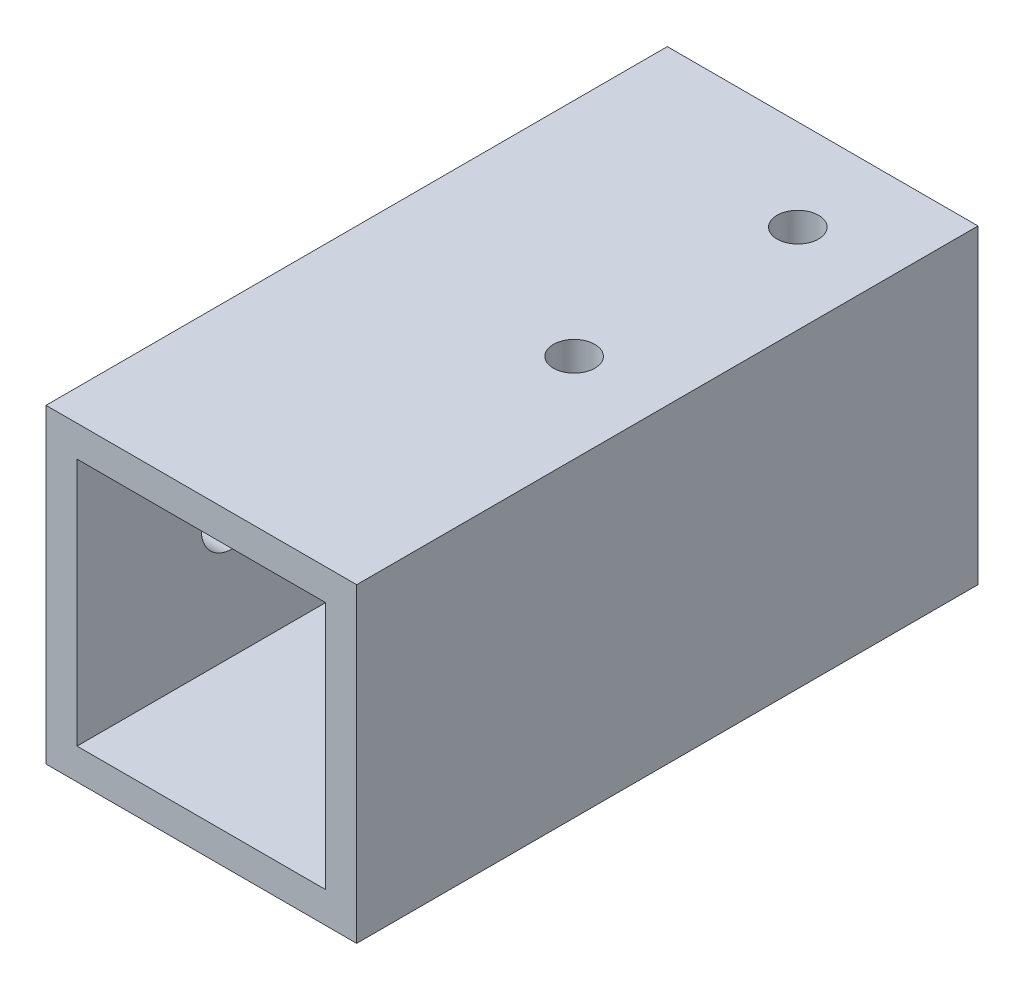
ISO-10303-21;
HEADER;
FILE_DESCRIPTION(('STEP AP214'),'2;1');
FILE_NAME('part.step','',(''),(''),'','','');
FILE_SCHEMA(('AUTOMOTIVE_DESIGN { 1 0 10303 214 1 1 1 1 }'));
ENDSEC;
DATA;
#1=APPLICATION_CONTEXT('core data for automotive mechanical design processes');
#2=APPLICATION_PROTOCOL_DEFINITION('international standard','automotive_design',2000,#1);
#3=PRODUCT_CONTEXT('',#1,'mechanical');
#4=PRODUCT('Part','Part','',(#3));
#5=PRODUCT_RELATED_PRODUCT_CATEGORY('part','',(#4));
#6=PRODUCT_DEFINITION_FORMATION('','',#4);
#7=PRODUCT_DEFINITION_CONTEXT('part definition',#1,'design');
#8=PRODUCT_DEFINITION('design','',#6,#7);
#9=PRODUCT_DEFINITION_SHAPE('','',#8);
#10=(LENGTH_UNIT() NAMED_UNIT(*) SI_UNIT(.MILLI.,.METRE.));
#11=(NAMED_UNIT(*) PLANE_ANGLE_UNIT() SI_UNIT($,.RADIAN.));
#12=(NAMED_UNIT(*) SI_UNIT($,.STERADIAN.) SOLID_ANGLE_UNIT());
#13=UNCERTAINTY_MEASURE_WITH_UNIT(LENGTH_MEASURE(1.E-05),#10,'distance_accuracy_value','');
#14=(GEOMETRIC_REPRESENTATION_CONTEXT(3) GLOBAL_UNCERTAINTY_ASSIGNED_CONTEXT((#13)) GLOBAL_UNIT_ASSIGNED_CONTEXT((#10,
#11,#12)) REPRESENTATION_CONTEXT('',''));
#15=CARTESIAN_POINT('',(0.,0.,0.));
#16=DIRECTION('',(0.,0.,1.));
#17=DIRECTION('',(1.,0.,0.));
#18=AXIS2_PLACEMENT_3D('',#15,#16,#17);
#19=CARTESIAN_POINT('',(0.,0.,-30.));
#20=DIRECTION('',(0.,0.,-1.));
#21=DIRECTION('',(1.,0.,0.));
#22=AXIS2_PLACEMENT_3D('',#19,#20,#21);
#23=PLANE('',#22);
#24=DIRECTION('',(0.,-1.,0.));
#25=VECTOR('',#24,1.);
#26=CARTESIAN_POINT('',(-7.01008414074451,7.73262608579252,-30.));
#27=LINE('',#26,#25);
#28=CARTESIAN_POINT('',(-7.01008414074451,7.73262608579252,-30.));
#29=VERTEX_POINT('',#28);
#30=CARTESIAN_POINT('',(-7.01008414074451,-7.26737391420748,-30.));
#31=VERTEX_POINT('',#30);
#32=EDGE_CURVE('E138',#29,#31,#27,.T.);
#33=ORIENTED_EDGE('',*,*,#32,.F.);
#34=DIRECTION('',(-1.,0.,0.));
#35=VECTOR('',#34,1.);
#36=CARTESIAN_POINT('',(-7.01008414074451,7.73262608579252,-30.));
#37=LINE('',#36,#35);
#38=CARTESIAN_POINT('',(7.98991585925549,7.73262608579252,-30.));
#39=VERTEX_POINT('',#38);
#40=EDGE_CURVE('E148',#39,#29,#37,.T.);
#41=ORIENTED_EDGE('',*,*,#40,.F.);
#42=DIRECTION('',(0.,1.,0.));
#43=VECTOR('',#42,1.);
#44=CARTESIAN_POINT('',(7.98991585925549,7.73262608579252,-30.));
#45=LINE('',#44,#43);
#46=CARTESIAN_POINT('',(7.98991585925548,-7.26737391420748,-30.));
#47=VERTEX_POINT('',#46);
#48=EDGE_CURVE('E145',#47,#39,#45,.T.);
#49=ORIENTED_EDGE('',*,*,#48,.F.);
#50=DIRECTION('',(1.,0.,0.));
#51=VECTOR('',#50,1.);
#52=CARTESIAN_POINT('',(-7.01008414074451,-7.26737391420748,-30.));
#53=LINE('',#52,#51);
#54=EDGE_CURVE('E141',#31,#47,#53,.T.);
#55=ORIENTED_EDGE('',*,*,#54,.F.);
#56=EDGE_LOOP('',(#33,#41,#49,#55));
#57=FACE_BOUND('',#56,.T.);
#58=DIRECTION('',(1.,0.,0.));
#59=VECTOR('',#58,1.);
#60=CARTESIAN_POINT('',(-5.51008414074451,-5.76737391420748,-30.));
#61=LINE('',#60,#59);
#62=CARTESIAN_POINT('',(-5.51008414074451,-5.76737391420748,-30.));
#63=VERTEX_POINT('',#62);
#64=CARTESIAN_POINT('',(6.48991585925549,-5.76737391420748,-30.));
#65=VERTEX_POINT('',#64);
#66=EDGE_CURVE('E117',#63,#65,#61,.T.);
#67=ORIENTED_EDGE('',*,*,#66,.T.);
#68=DIRECTION('',(0.,1.,0.));
#69=VECTOR('',#68,1.);
#70=CARTESIAN_POINT('',(6.48991585925549,6.23262608579252,-30.));
#71=LINE('',#70,#69);
#72=CARTESIAN_POINT('',(6.48991585925549,6.23262608579252,-30.));
#73=VERTEX_POINT('',#72);
#74=EDGE_CURVE('E122',#65,#73,#71,.T.);
#75=ORIENTED_EDGE('',*,*,#74,.T.);
#76=DIRECTION('',(-1.,0.,0.));
#77=VECTOR('',#76,1.);
#78=CARTESIAN_POINT('',(-5.51008414074451,6.23262608579252,-30.));
#79=LINE('',#78,#77);
#80=CARTESIAN_POINT('',(-5.51008414074451,6.23262608579252,-30.));
#81=VERTEX_POINT('',#80);
#82=EDGE_CURVE('E118',#73,#81,#79,.T.);
#83=ORIENTED_EDGE('',*,*,#82,.T.);
#84=DIRECTION('',(0.,-1.,0.));
#85=VECTOR('',#84,1.);
#86=CARTESIAN_POINT('',(-5.51008414074451,6.23262608579252,-30.));
#87=LINE('',#86,#85);
#88=EDGE_CURVE('E103',#81,#63,#87,.T.);
#89=ORIENTED_EDGE('',*,*,#88,.T.);
#90=EDGE_LOOP('',(#67,#75,#83,#89));
#91=FACE_BOUND('',#90,.T.);
#92=ADVANCED_FACE('F35',(#57,#91),#23,.T.);
#93=CARTESIAN_POINT('',(0.,0.,0.));
#94=DIRECTION('',(0.,0.,-1.));
#95=DIRECTION('',(1.,0.,0.));
#96=AXIS2_PLACEMENT_3D('',#93,#94,#95);
#97=PLANE('',#96);
#98=DIRECTION('',(0.,-1.,0.));
#99=VECTOR('',#98,1.);
#100=CARTESIAN_POINT('',(-7.01008414074451,7.73262608579252,0.));
#101=LINE('',#100,#99);
#102=CARTESIAN_POINT('',(-7.01008414074451,7.73262608579252,0.));
#103=VERTEX_POINT('',#102);
#104=CARTESIAN_POINT('',(-7.01008414074451,-7.26737391420748,0.));
#105=VERTEX_POINT('',#104);
#106=EDGE_CURVE('E111',#103,#105,#101,.T.);
#107=ORIENTED_EDGE('',*,*,#106,.T.);
#108=DIRECTION('',(1.,0.,0.));
#109=VECTOR('',#108,1.);
#110=CARTESIAN_POINT('',(-7.01008414074451,-7.26737391420748,0.));
#111=LINE('',#110,#109);
#112=CARTESIAN_POINT('',(7.98991585925548,-7.26737391420748,0.));
#113=VERTEX_POINT('',#112);
#114=EDGE_CURVE('E154',#105,#113,#111,.T.);
#115=ORIENTED_EDGE('',*,*,#114,.T.);
#116=DIRECTION('',(0.,1.,0.));
#117=VECTOR('',#116,1.);
#118=CARTESIAN_POINT('',(7.98991585925549,7.73262608579252,0.));
#119=LINE('',#118,#117);
#120=CARTESIAN_POINT('',(7.98991585925549,7.73262608579252,0.));
#121=VERTEX_POINT('',#120);
#122=EDGE_CURVE('E157',#113,#121,#119,.T.);
#123=ORIENTED_EDGE('',*,*,#122,.T.);
#124=DIRECTION('',(-1.,0.,0.));
#125=VECTOR('',#124,1.);
#126=CARTESIAN_POINT('',(-7.01008414074451,7.73262608579252,0.));
#127=LINE('',#126,#125);
#128=EDGE_CURVE('E142',#121,#103,#127,.T.);
#129=ORIENTED_EDGE('',*,*,#128,.T.);
#130=EDGE_LOOP('',(#107,#115,#123,#129));
#131=FACE_BOUND('',#130,.T.);
#132=DIRECTION('',(0.,-1.,0.));
#133=VECTOR('',#132,1.);
#134=CARTESIAN_POINT('',(-5.51008414074451,6.23262608579252,0.));
#135=LINE('',#134,#133);
#136=CARTESIAN_POINT('',(-5.51008414074451,6.23262608579252,0.));
#137=VERTEX_POINT('',#136);
#138=CARTESIAN_POINT('',(-5.51008414074451,-5.76737391420748,0.));
#139=VERTEX_POINT('',#138);
#140=EDGE_CURVE('E106',#137,#139,#135,.T.);
#141=ORIENTED_EDGE('',*,*,#140,.F.);
#142=DIRECTION('',(-1.,0.,0.));
#143=VECTOR('',#142,1.);
#144=CARTESIAN_POINT('',(-5.51008414074451,6.23262608579252,0.));
#145=LINE('',#144,#143);
#146=CARTESIAN_POINT('',(6.48991585925549,6.23262608579252,0.));
#147=VERTEX_POINT('',#146);
#148=EDGE_CURVE('E119',#147,#137,#145,.T.);
#149=ORIENTED_EDGE('',*,*,#148,.F.);
#150=DIRECTION('',(0.,1.,0.));
#151=VECTOR('',#150,1.);
#152=CARTESIAN_POINT('',(6.48991585925549,6.23262608579252,0.));
#153=LINE('',#152,#151);
#154=CARTESIAN_POINT('',(6.48991585925549,-5.76737391420748,0.));
#155=VERTEX_POINT('',#154);
#156=EDGE_CURVE('E132',#155,#147,#153,.T.);
#157=ORIENTED_EDGE('',*,*,#156,.F.);
#158=DIRECTION('',(1.,0.,0.));
#159=VECTOR('',#158,1.);
#160=CARTESIAN_POINT('',(-5.51008414074451,-5.76737391420748,0.));
#161=LINE('',#160,#159);
#162=EDGE_CURVE('E129',#139,#155,#161,.T.);
#163=ORIENTED_EDGE('',*,*,#162,.F.);
#164=EDGE_LOOP('',(#141,#149,#157,#163));
#165=FACE_BOUND('',#164,.T.);
#166=ADVANCED_FACE('F210',(#131,#165),#97,.F.);
#167=CARTESIAN_POINT('',(-7.01008414074451,7.73262608579252,-30.));
#168=DIRECTION('',(1.,0.,0.));
#169=DIRECTION('',(0.,1.,0.));
#170=AXIS2_PLACEMENT_3D('',#167,#168,#169);
#171=PLANE('',#170);
#172=CARTESIAN_POINT('',(-7.01008414074451,0.232626085792518,-7.5));
#173=DIRECTION('',(1.,0.,0.));
#174=DIRECTION('',(0.,-1.,0.));
#175=AXIS2_PLACEMENT_3D('',#172,#173,#174);
#176=CIRCLE('',#175,1.5);
#177=CARTESIAN_POINT('',(-7.01008414074451,-1.26737391420748,-7.5));
#178=VERTEX_POINT('',#177);
#179=EDGE_CURVE('E174',#178,#178,#176,.T.);
#180=ORIENTED_EDGE('',*,*,#179,.T.);
#181=EDGE_LOOP('',(#180));
#182=FACE_BOUND('',#181,.T.);
#183=ORIENTED_EDGE('',*,*,#106,.F.);
#184=DIRECTION('',(0.,0.,1.));
#185=VECTOR('',#184,1.);
#186=CARTESIAN_POINT('',(-7.01008414074451,7.73262608579252,-30.));
#187=LINE('',#186,#185);
#188=EDGE_CURVE('E151',#29,#103,#187,.T.);
#189=ORIENTED_EDGE('',*,*,#188,.F.);
#190=ORIENTED_EDGE('',*,*,#32,.T.);
#191=DIRECTION('',(0.,0.,1.));
#192=VECTOR('',#191,1.);
#193=CARTESIAN_POINT('',(-7.01008414074451,-7.26737391420748,-30.));
#194=LINE('',#193,#192);
#195=EDGE_CURVE('E11',#31,#105,#194,.T.);
#196=ORIENTED_EDGE('',*,*,#195,.T.);
#197=EDGE_LOOP('',(#183,#189,#190,#196));
#198=FACE_BOUND('',#197,.T.);
#199=ADVANCED_FACE('F37',(#182,#198),#171,.F.);
#200=CARTESIAN_POINT('',(-7.01008414074451,-7.26737391420748,-30.));
#201=DIRECTION('',(0.,1.,0.));
#202=DIRECTION('',(0.,0.,-1.));
#203=AXIS2_PLACEMENT_3D('',#200,#201,#202);
#204=PLANE('',#203);
#205=CARTESIAN_POINT('',(0.489915859255484,-7.26737391420748,-22.5));
#206=DIRECTION('',(0.,1.,0.));
#207=DIRECTION('',(0.,0.,1.));
#208=AXIS2_PLACEMENT_3D('',#205,#206,#207);
#209=CIRCLE('',#208,1.5);
#210=CARTESIAN_POINT('',(0.489915859255484,-7.26737391420748,-21.));
#211=VERTEX_POINT('',#210);
#212=EDGE_CURVE('E183',#211,#211,#209,.T.);
#213=ORIENTED_EDGE('',*,*,#212,.T.);
#214=EDGE_LOOP('',(#213));
#215=FACE_BOUND('',#214,.T.);
#216=ORIENTED_EDGE('',*,*,#114,.F.);
#217=ORIENTED_EDGE('',*,*,#195,.F.);
#218=ORIENTED_EDGE('',*,*,#54,.T.);
#219=DIRECTION('',(0.,0.,1.));
#220=VECTOR('',#219,1.);
#221=CARTESIAN_POINT('',(7.98991585925548,-7.26737391420748,-30.));
#222=LINE('',#221,#220);
#223=EDGE_CURVE('E44',#47,#113,#222,.T.);
#224=ORIENTED_EDGE('',*,*,#223,.T.);
#225=EDGE_LOOP('',(#216,#217,#218,#224));
#226=FACE_BOUND('',#225,.T.);
#227=ADVANCED_FACE('F226',(#215,#226),#204,.F.);
#228=CARTESIAN_POINT('',(7.98991585925549,7.73262608579252,-30.));
#229=DIRECTION('',(-1.,0.,0.));
#230=DIRECTION('',(0.,-1.,0.));
#231=AXIS2_PLACEMENT_3D('',#228,#229,#230);
#232=PLANE('',#231);
#233=ORIENTED_EDGE('',*,*,#122,.F.);
#234=ORIENTED_EDGE('',*,*,#223,.F.);
#235=ORIENTED_EDGE('',*,*,#48,.T.);
#236=DIRECTION('',(0.,0.,1.));
#237=VECTOR('',#236,1.);
#238=CARTESIAN_POINT('',(7.98991585925549,7.73262608579252,-30.));
#239=LINE('',#238,#237);
#240=EDGE_CURVE('E163',#39,#121,#239,.T.);
#241=ORIENTED_EDGE('',*,*,#240,.T.);
#242=EDGE_LOOP('',(#233,#234,#235,#241));
#243=FACE_BOUND('',#242,.T.);
#244=ADVANCED_FACE('F224',(#243),#232,.F.);
#245=CARTESIAN_POINT('',(-7.01008414074451,7.73262608579252,-30.));
#246=DIRECTION('',(0.,-1.,0.));
#247=DIRECTION('',(0.,0.,1.));
#248=AXIS2_PLACEMENT_3D('',#245,#246,#247);
#249=PLANE('',#248);
#250=CARTESIAN_POINT('',(3.68991585925549,7.73262608579252,-25.6));
#251=DIRECTION('',(0.,-1.,0.));
#252=DIRECTION('',(0.,0.,-1.));
#253=AXIS2_PLACEMENT_3D('',#250,#251,#252);
#254=CIRCLE('',#253,1.);
#255=CARTESIAN_POINT('',(3.68991585925549,7.73262608579252,-26.6));
#256=VERTEX_POINT('',#255);
#257=EDGE_CURVE('E169',#256,#256,#254,.T.);
#258=ORIENTED_EDGE('',*,*,#257,.T.);
#259=EDGE_LOOP('',(#258));
#260=FACE_BOUND('',#259,.T.);
#261=CARTESIAN_POINT('',(3.68991585925549,7.73262608579252,-14.8));
#262=DIRECTION('',(0.,-1.,0.));
#263=DIRECTION('',(0.,0.,-1.));
#264=AXIS2_PLACEMENT_3D('',#261,#262,#263);
#265=CIRCLE('',#264,1.);
#266=CARTESIAN_POINT('',(3.68991585925549,7.73262608579252,-15.8));
#267=VERTEX_POINT('',#266);
#268=EDGE_CURVE('E173',#267,#267,#265,.T.);
#269=ORIENTED_EDGE('',*,*,#268,.T.);
#270=EDGE_LOOP('',(#269));
#271=FACE_BOUND('',#270,.T.);
#272=ORIENTED_EDGE('',*,*,#128,.F.);
#273=ORIENTED_EDGE('',*,*,#240,.F.);
#274=ORIENTED_EDGE('',*,*,#40,.T.);
#275=ORIENTED_EDGE('',*,*,#188,.T.);
#276=EDGE_LOOP('',(#272,#273,#274,#275));
#277=FACE_BOUND('',#276,.T.);
#278=ADVANCED_FACE('F189',(#260,#271,#277),#249,.F.);
#279=CARTESIAN_POINT('',(-5.51008414074451,6.23262608579252,-30.));
#280=DIRECTION('',(1.,0.,0.));
#281=DIRECTION('',(0.,1.,0.));
#282=AXIS2_PLACEMENT_3D('',#279,#280,#281);
#283=PLANE('',#282);
#284=CARTESIAN_POINT('',(-5.51008414074451,0.232626085792519,-7.5));
#285=DIRECTION('',(-1.,0.,0.));
#286=DIRECTION('',(0.,1.,0.));
#287=AXIS2_PLACEMENT_3D('',#284,#285,#286);
#288=CIRCLE('',#287,1.5);
#289=CARTESIAN_POINT('',(-5.51008414074451,1.73262608579252,-7.5));
#290=VERTEX_POINT('',#289);
#291=EDGE_CURVE('E171',#290,#290,#288,.T.);
#292=ORIENTED_EDGE('',*,*,#291,.T.);
#293=EDGE_LOOP('',(#292));
#294=FACE_BOUND('',#293,.T.);
#295=ORIENTED_EDGE('',*,*,#140,.T.);
#296=DIRECTION('',(0.,0.,1.));
#297=VECTOR('',#296,1.);
#298=CARTESIAN_POINT('',(-5.51008414074451,-5.76737391420748,-30.));
#299=LINE('',#298,#297);
#300=EDGE_CURVE('E100',#63,#139,#299,.T.);
#301=ORIENTED_EDGE('',*,*,#300,.F.);
#302=ORIENTED_EDGE('',*,*,#88,.F.);
#303=DIRECTION('',(0.,0.,1.));
#304=VECTOR('',#303,1.);
#305=CARTESIAN_POINT('',(-5.51008414074451,6.23262608579252,-30.));
#306=LINE('',#305,#304);
#307=EDGE_CURVE('E60',#81,#137,#306,.T.);
#308=ORIENTED_EDGE('',*,*,#307,.T.);
#309=EDGE_LOOP('',(#295,#301,#302,#308));
#310=FACE_BOUND('',#309,.T.);
#311=ADVANCED_FACE('F102',(#294,#310),#283,.T.);
#312=CARTESIAN_POINT('',(-5.51008414074451,-5.76737391420748,-30.));
#313=DIRECTION('',(0.,1.,0.));
#314=DIRECTION('',(0.,0.,-1.));
#315=AXIS2_PLACEMENT_3D('',#312,#313,#314);
#316=PLANE('',#315);
#317=CARTESIAN_POINT('',(0.489915859255484,-5.76737391420748,-22.5));
#318=DIRECTION('',(0.,-1.,0.));
#319=DIRECTION('',(0.,0.,-1.));
#320=AXIS2_PLACEMENT_3D('',#317,#318,#319);
#321=CIRCLE('',#320,1.5);
#322=CARTESIAN_POINT('',(0.489915859255484,-5.76737391420748,-24.));
#323=VERTEX_POINT('',#322);
#324=EDGE_CURVE('E39',#323,#323,#321,.T.);
#325=ORIENTED_EDGE('',*,*,#324,.T.);
#326=EDGE_LOOP('',(#325));
#327=FACE_BOUND('',#326,.T.);
#328=ORIENTED_EDGE('',*,*,#162,.T.);
#329=DIRECTION('',(0.,0.,1.));
#330=VECTOR('',#329,1.);
#331=CARTESIAN_POINT('',(6.48991585925549,-5.76737391420748,-30.));
#332=LINE('',#331,#330);
#333=EDGE_CURVE('E112',#65,#155,#332,.T.);
#334=ORIENTED_EDGE('',*,*,#333,.F.);
#335=ORIENTED_EDGE('',*,*,#66,.F.);
#336=ORIENTED_EDGE('',*,*,#300,.T.);
#337=EDGE_LOOP('',(#328,#334,#335,#336));
#338=FACE_BOUND('',#337,.T.);
#339=ADVANCED_FACE('F121',(#327,#338),#316,.T.);
#340=CARTESIAN_POINT('',(6.48991585925549,6.23262608579252,-30.));
#341=DIRECTION('',(-1.,0.,0.));
#342=DIRECTION('',(0.,-1.,0.));
#343=AXIS2_PLACEMENT_3D('',#340,#341,#342);
#344=PLANE('',#343);
#345=ORIENTED_EDGE('',*,*,#156,.T.);
#346=DIRECTION('',(0.,0.,1.));
#347=VECTOR('',#346,1.);
#348=CARTESIAN_POINT('',(6.48991585925549,6.23262608579252,-30.));
#349=LINE('',#348,#347);
#350=EDGE_CURVE('E52',#73,#147,#349,.T.);
#351=ORIENTED_EDGE('',*,*,#350,.F.);
#352=ORIENTED_EDGE('',*,*,#74,.F.);
#353=ORIENTED_EDGE('',*,*,#333,.T.);
#354=EDGE_LOOP('',(#345,#351,#352,#353));
#355=FACE_BOUND('',#354,.T.);
#356=ADVANCED_FACE('F248',(#355),#344,.T.);
#357=CARTESIAN_POINT('',(-5.51008414074451,6.23262608579252,-30.));
#358=DIRECTION('',(0.,-1.,0.));
#359=DIRECTION('',(0.,0.,1.));
#360=AXIS2_PLACEMENT_3D('',#357,#358,#359);
#361=PLANE('',#360);
#362=CARTESIAN_POINT('',(3.68991585925549,6.23262608579252,-25.6));
#363=DIRECTION('',(0.,1.,0.));
#364=DIRECTION('',(0.,0.,1.));
#365=AXIS2_PLACEMENT_3D('',#362,#363,#364);
#366=CIRCLE('',#365,1.);
#367=CARTESIAN_POINT('',(3.68991585925549,6.23262608579252,-24.6));
#368=VERTEX_POINT('',#367);
#369=EDGE_CURVE('E130',#368,#368,#366,.T.);
#370=ORIENTED_EDGE('',*,*,#369,.T.);
#371=EDGE_LOOP('',(#370));
#372=FACE_BOUND('',#371,.T.);
#373=CARTESIAN_POINT('',(3.68991585925549,6.23262608579252,-14.8));
#374=DIRECTION('',(0.,1.,0.));
#375=DIRECTION('',(0.,0.,1.));
#376=AXIS2_PLACEMENT_3D('',#373,#374,#375);
#377=CIRCLE('',#376,1.);
#378=CARTESIAN_POINT('',(3.68991585925549,6.23262608579252,-13.8));
#379=VERTEX_POINT('',#378);
#380=EDGE_CURVE('E166',#379,#379,#377,.T.);
#381=ORIENTED_EDGE('',*,*,#380,.T.);
#382=EDGE_LOOP('',(#381));
#383=FACE_BOUND('',#382,.T.);
#384=ORIENTED_EDGE('',*,*,#148,.T.);
#385=ORIENTED_EDGE('',*,*,#307,.F.);
#386=ORIENTED_EDGE('',*,*,#82,.F.);
#387=ORIENTED_EDGE('',*,*,#350,.T.);
#388=EDGE_LOOP('',(#384,#385,#386,#387));
#389=FACE_BOUND('',#388,.T.);
#390=ADVANCED_FACE('F205',(#372,#383,#389),#361,.T.);
#391=CARTESIAN_POINT('',(3.68991585925549,-2.26737391420748,-14.8));
#392=DIRECTION('',(0.,1.,0.));
#393=DIRECTION('',(0.,0.,-1.));
#394=AXIS2_PLACEMENT_3D('',#391,#392,#393);
#395=CYLINDRICAL_SURFACE('',#394,1.);
#396=ORIENTED_EDGE('',*,*,#380,.F.);
#397=EDGE_LOOP('',(#396));
#398=FACE_BOUND('',#397,.T.);
#399=ORIENTED_EDGE('',*,*,#268,.F.);
#400=EDGE_LOOP('',(#399));
#401=FACE_BOUND('',#400,.T.);
#402=ADVANCED_FACE('F195',(#398,#401),#395,.F.);
#403=CARTESIAN_POINT('',(3.68991585925549,-2.26737391420748,-25.6));
#404=DIRECTION('',(0.,1.,0.));
#405=DIRECTION('',(0.,0.,-1.));
#406=AXIS2_PLACEMENT_3D('',#403,#404,#405);
#407=CYLINDRICAL_SURFACE('',#406,1.);
#408=ORIENTED_EDGE('',*,*,#369,.F.);
#409=EDGE_LOOP('',(#408));
#410=FACE_BOUND('',#409,.T.);
#411=ORIENTED_EDGE('',*,*,#257,.F.);
#412=EDGE_LOOP('',(#411));
#413=FACE_BOUND('',#412,.T.);
#414=ADVANCED_FACE('F192',(#410,#413),#407,.F.);
#415=CARTESIAN_POINT('',(2.98991585925549,0.23262608579252,-7.5));
#416=DIRECTION('',(-1.,0.,0.));
#417=DIRECTION('',(0.,-1.,0.));
#418=AXIS2_PLACEMENT_3D('',#415,#416,#417);
#419=CYLINDRICAL_SURFACE('',#418,1.5);
#420=ORIENTED_EDGE('',*,*,#291,.F.);
#421=EDGE_LOOP('',(#420));
#422=FACE_BOUND('',#421,.T.);
#423=ORIENTED_EDGE('',*,*,#179,.F.);
#424=EDGE_LOOP('',(#423));
#425=FACE_BOUND('',#424,.T.);
#426=ADVANCED_FACE('F194',(#422,#425),#419,.F.);
#427=CARTESIAN_POINT('',(0.489915859255484,2.73262608579252,-22.5));
#428=DIRECTION('',(0.,-1.,0.));
#429=DIRECTION('',(0.,0.,1.));
#430=AXIS2_PLACEMENT_3D('',#427,#428,#429);
#431=CYLINDRICAL_SURFACE('',#430,1.5);
#432=ORIENTED_EDGE('',*,*,#324,.F.);
#433=EDGE_LOOP('',(#432));
#434=FACE_BOUND('',#433,.T.);
#435=ORIENTED_EDGE('',*,*,#212,.F.);
#436=EDGE_LOOP('',(#435));
#437=FACE_BOUND('',#436,.T.);
#438=ADVANCED_FACE('F202',(#434,#437),#431,.F.);
#439=CLOSED_SHELL('',(#92,#166,#199,#227,#244,#278,#311,#339,#356,#390,#402,#414,#426,#438));
#440=MANIFOLD_SOLID_BREP('B2',#439);
#441=ADVANCED_BREP_SHAPE_REPRESENTATION('',(#18,#440),#14);
#442=SHAPE_DEFINITION_REPRESENTATION(#9,#441);
ENDSEC;
END-ISO-10303-21;
